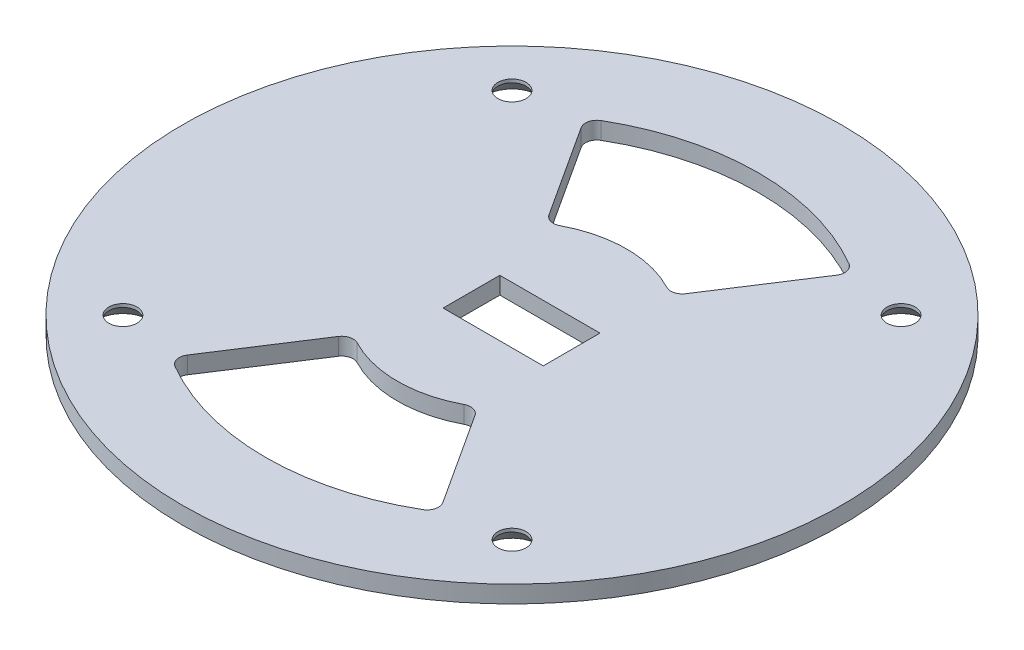
ISO-10303-21;
HEADER;
FILE_DESCRIPTION(('STEP AP214'),'2;1');
FILE_NAME('part.step','',(''),(''),'','','');
FILE_SCHEMA(('AUTOMOTIVE_DESIGN { 1 0 10303 214 1 1 1 1 }'));
ENDSEC;
DATA;
#1=APPLICATION_CONTEXT('core data for automotive mechanical design processes');
#2=APPLICATION_PROTOCOL_DEFINITION('international standard','automotive_design',2000,#1);
#3=PRODUCT_CONTEXT('',#1,'mechanical');
#4=PRODUCT('Part','Part','',(#3));
#5=PRODUCT_RELATED_PRODUCT_CATEGORY('part','',(#4));
#6=PRODUCT_DEFINITION_FORMATION('','',#4);
#7=PRODUCT_DEFINITION_CONTEXT('part definition',#1,'design');
#8=PRODUCT_DEFINITION('design','',#6,#7);
#9=PRODUCT_DEFINITION_SHAPE('','',#8);
#10=(LENGTH_UNIT() NAMED_UNIT(*) SI_UNIT(.MILLI.,.METRE.));
#11=(NAMED_UNIT(*) PLANE_ANGLE_UNIT() SI_UNIT($,.RADIAN.));
#12=(NAMED_UNIT(*) SI_UNIT($,.STERADIAN.) SOLID_ANGLE_UNIT());
#13=UNCERTAINTY_MEASURE_WITH_UNIT(LENGTH_MEASURE(1.E-05),#10,'distance_accuracy_value','');
#14=(GEOMETRIC_REPRESENTATION_CONTEXT(3) GLOBAL_UNCERTAINTY_ASSIGNED_CONTEXT((#13)) GLOBAL_UNIT_ASSIGNED_CONTEXT((#10,
#11,#12)) REPRESENTATION_CONTEXT('',''));
#15=CARTESIAN_POINT('',(0.,0.,0.));
#16=DIRECTION('',(0.,0.,1.));
#17=DIRECTION('',(1.,0.,0.));
#18=AXIS2_PLACEMENT_3D('',#15,#16,#17);
#19=CARTESIAN_POINT('',(0.,3.,0.));
#20=DIRECTION('',(0.,1.,0.));
#21=DIRECTION('',(0.,0.,1.));
#22=AXIS2_PLACEMENT_3D('',#19,#20,#21);
#23=PLANE('',#22);
#24=DIRECTION('',(-0.54427744861526,0.,0.838905274109576));
#25=VECTOR('',#24,1.);
#26=CARTESIAN_POINT('',(23.4039302904562,3.,-36.0729267867118));
#27=LINE('',#26,#25);
#28=CARTESIAN_POINT('',(22.2888094607203,3.,-34.3541696570257));
#29=VERTEX_POINT('',#28);
#30=CARTESIAN_POINT('',(11.9245214459175,3.,-18.3794936895948));
#31=VERTEX_POINT('',#30);
#32=EDGE_CURVE('E359',#29,#31,#27,.T.);
#33=ORIENTED_EDGE('',*,*,#32,.T.);
#34=CARTESIAN_POINT('',(10.2467108976983,3.,-19.4680485868253));
#35=DIRECTION('',(0.,1.,0.));
#36=DIRECTION('',(0.,0.,1.));
#37=AXIS2_PLACEMENT_3D('',#34,#35,#36);
#38=CIRCLE('',#37,2.);
#39=CARTESIAN_POINT('',(9.31519172518029,3.,-17.698225988023));
#40=VERTEX_POINT('',#39);
#41=EDGE_CURVE('E309',#31,#40,#38,.F.);
#42=ORIENTED_EDGE('',*,*,#41,.T.);
#43=CARTESIAN_POINT('',(0.,3.,0.));
#44=DIRECTION('',(0.,1.,0.));
#45=DIRECTION('',(0.,0.,1.));
#46=AXIS2_PLACEMENT_3D('',#43,#44,#45);
#47=CIRCLE('',#46,20.);
#48=CARTESIAN_POINT('',(-9.31519172518029,3.,-17.698225988023));
#49=VERTEX_POINT('',#48);
#50=EDGE_CURVE('E629',#40,#49,#47,.T.);
#51=ORIENTED_EDGE('',*,*,#50,.T.);
#52=CARTESIAN_POINT('',(-10.2467108976983,3.,-19.4680485868253));
#53=DIRECTION('',(0.,1.,0.));
#54=DIRECTION('',(0.,0.,1.));
#55=AXIS2_PLACEMENT_3D('',#52,#53,#54);
#56=CIRCLE('',#55,2.);
#57=CARTESIAN_POINT('',(-11.9245214459175,3.,-18.3794936895948));
#58=VERTEX_POINT('',#57);
#59=EDGE_CURVE('E313',#49,#58,#56,.F.);
#60=ORIENTED_EDGE('',*,*,#59,.T.);
#61=DIRECTION('',(-0.54427744861526,0.,-0.838905274109576));
#62=VECTOR('',#61,1.);
#63=CARTESIAN_POINT('',(-23.4039302904562,3.,-36.0729267867118));
#64=LINE('',#63,#62);
#65=CARTESIAN_POINT('',(-22.2888094607203,3.,-34.3541696570257));
#66=VERTEX_POINT('',#65);
#67=EDGE_CURVE('E623',#58,#66,#64,.T.);
#68=ORIENTED_EDGE('',*,*,#67,.T.);
#69=CARTESIAN_POINT('',(-20.6109989125012,3.,-35.4427245542562));
#70=DIRECTION('',(0.,1.,0.));
#71=DIRECTION('',(0.,0.,1.));
#72=AXIS2_PLACEMENT_3D('',#69,#70,#71);
#73=CIRCLE('',#72,2.);
#74=CARTESIAN_POINT('',(-21.6164134935988,3.,-37.1716379471467));
#75=VERTEX_POINT('',#74);
#76=EDGE_CURVE('E305',#66,#75,#73,.F.);
#77=ORIENTED_EDGE('',*,*,#76,.T.);
#78=CARTESIAN_POINT('',(0.,3.,0.));
#79=DIRECTION('',(0.,-1.,0.));
#80=DIRECTION('',(0.,0.,1.));
#81=AXIS2_PLACEMENT_3D('',#78,#79,#80);
#82=CIRCLE('',#81,43.);
#83=CARTESIAN_POINT('',(21.6164134935988,3.,-37.1716379471467));
#84=VERTEX_POINT('',#83);
#85=EDGE_CURVE('E621',#75,#84,#82,.T.);
#86=ORIENTED_EDGE('',*,*,#85,.T.);
#87=CARTESIAN_POINT('',(20.6109989125012,3.,-35.4427245542562));
#88=DIRECTION('',(0.,1.,0.));
#89=DIRECTION('',(0.,0.,1.));
#90=AXIS2_PLACEMENT_3D('',#87,#88,#89);
#91=CIRCLE('',#90,2.);
#92=EDGE_CURVE('E301',#84,#29,#91,.F.);
#93=ORIENTED_EDGE('',*,*,#92,.T.);
#94=EDGE_LOOP('',(#33,#42,#51,#60,#68,#77,#86,#93));
#95=FACE_BOUND('',#94,.T.);
#96=DIRECTION('',(0.54427744861526,0.,0.838905274109576));
#97=VECTOR('',#96,1.);
#98=CARTESIAN_POINT('',(23.4039302904562,3.,36.0729267867118));
#99=LINE('',#98,#97);
#100=CARTESIAN_POINT('',(11.9245214459175,3.,18.3794936895948));
#101=VERTEX_POINT('',#100);
#102=CARTESIAN_POINT('',(22.2888094607203,3.,34.3541696570257));
#103=VERTEX_POINT('',#102);
#104=EDGE_CURVE('E199',#101,#103,#99,.T.);
#105=ORIENTED_EDGE('',*,*,#104,.T.);
#106=CARTESIAN_POINT('',(20.6109989125012,3.,35.4427245542562));
#107=DIRECTION('',(0.,1.,0.));
#108=DIRECTION('',(0.,0.,1.));
#109=AXIS2_PLACEMENT_3D('',#106,#107,#108);
#110=CIRCLE('',#109,2.);
#111=CARTESIAN_POINT('',(21.6164134935988,3.,37.1716379471467));
#112=VERTEX_POINT('',#111);
#113=EDGE_CURVE('E11',#103,#112,#110,.F.);
#114=ORIENTED_EDGE('',*,*,#113,.T.);
#115=CARTESIAN_POINT('',(0.,3.,0.));
#116=DIRECTION('',(0.,-1.,0.));
#117=DIRECTION('',(0.,0.,-1.));
#118=AXIS2_PLACEMENT_3D('',#115,#116,#117);
#119=CIRCLE('',#118,43.);
#120=CARTESIAN_POINT('',(-21.6164134935988,3.,37.1716379471467));
#121=VERTEX_POINT('',#120);
#122=EDGE_CURVE('E337',#112,#121,#119,.T.);
#123=ORIENTED_EDGE('',*,*,#122,.T.);
#124=CARTESIAN_POINT('',(-20.6109989125012,3.,35.4427245542562));
#125=DIRECTION('',(0.,1.,0.));
#126=DIRECTION('',(0.,0.,1.));
#127=AXIS2_PLACEMENT_3D('',#124,#125,#126);
#128=CIRCLE('',#127,2.);
#129=CARTESIAN_POINT('',(-22.2888094607203,3.,34.3541696570257));
#130=VERTEX_POINT('',#129);
#131=EDGE_CURVE('E317',#121,#130,#128,.F.);
#132=ORIENTED_EDGE('',*,*,#131,.T.);
#133=DIRECTION('',(0.54427744861526,0.,-0.838905274109576));
#134=VECTOR('',#133,1.);
#135=CARTESIAN_POINT('',(-23.4039302904562,3.,36.0729267867118));
#136=LINE('',#135,#134);
#137=CARTESIAN_POINT('',(-11.9245214459175,3.,18.3794936895948));
#138=VERTEX_POINT('',#137);
#139=EDGE_CURVE('E346',#130,#138,#136,.T.);
#140=ORIENTED_EDGE('',*,*,#139,.T.);
#141=CARTESIAN_POINT('',(-10.2467108976983,3.,19.4680485868253));
#142=DIRECTION('',(0.,1.,0.));
#143=DIRECTION('',(0.,0.,1.));
#144=AXIS2_PLACEMENT_3D('',#141,#142,#143);
#145=CIRCLE('',#144,2.);
#146=CARTESIAN_POINT('',(-9.31519172518029,3.,17.698225988023));
#147=VERTEX_POINT('',#146);
#148=EDGE_CURVE('E321',#138,#147,#145,.F.);
#149=ORIENTED_EDGE('',*,*,#148,.T.);
#150=CARTESIAN_POINT('',(0.,3.,0.));
#151=DIRECTION('',(0.,1.,0.));
#152=DIRECTION('',(0.,0.,-1.));
#153=AXIS2_PLACEMENT_3D('',#150,#151,#152);
#154=CIRCLE('',#153,20.);
#155=CARTESIAN_POINT('',(9.31519172518029,3.,17.698225988023));
#156=VERTEX_POINT('',#155);
#157=EDGE_CURVE('E349',#147,#156,#154,.T.);
#158=ORIENTED_EDGE('',*,*,#157,.T.);
#159=CARTESIAN_POINT('',(10.2467108976983,3.,19.4680485868253));
#160=DIRECTION('',(0.,1.,0.));
#161=DIRECTION('',(0.,0.,1.));
#162=AXIS2_PLACEMENT_3D('',#159,#160,#161);
#163=CIRCLE('',#162,2.);
#164=EDGE_CURVE('E56',#156,#101,#163,.F.);
#165=ORIENTED_EDGE('',*,*,#164,.T.);
#166=EDGE_LOOP('',(#105,#114,#123,#132,#140,#149,#158,#165));
#167=FACE_BOUND('',#166,.T.);
#168=DIRECTION('',(0.,0.,-1.));
#169=VECTOR('',#168,1.);
#170=CARTESIAN_POINT('',(-7.07499999999999,3.,-4.95));
#171=LINE('',#170,#169);
#172=CARTESIAN_POINT('',(-7.07499999999999,3.,4.95));
#173=VERTEX_POINT('',#172);
#174=CARTESIAN_POINT('',(-7.07499999999999,3.,-4.95));
#175=VERTEX_POINT('',#174);
#176=EDGE_CURVE('E176',#173,#175,#171,.T.);
#177=ORIENTED_EDGE('',*,*,#176,.T.);
#178=DIRECTION('',(-1.,0.,0.));
#179=VECTOR('',#178,1.);
#180=CARTESIAN_POINT('',(-2.99999999999999,3.,-4.95));
#181=LINE('',#180,#179);
#182=CARTESIAN_POINT('',(10.4,3.,-4.95));
#183=VERTEX_POINT('',#182);
#184=EDGE_CURVE('E182',#183,#175,#181,.T.);
#185=ORIENTED_EDGE('',*,*,#184,.F.);
#186=DIRECTION('',(0.,0.,1.));
#187=VECTOR('',#186,1.);
#188=CARTESIAN_POINT('',(10.4,3.,-4.95));
#189=LINE('',#188,#187);
#190=CARTESIAN_POINT('',(10.4,3.,4.95));
#191=VERTEX_POINT('',#190);
#192=EDGE_CURVE('E178',#183,#191,#189,.T.);
#193=ORIENTED_EDGE('',*,*,#192,.T.);
#194=DIRECTION('',(1.,0.,0.));
#195=VECTOR('',#194,1.);
#196=CARTESIAN_POINT('',(-2.99999999999999,3.,4.95));
#197=LINE('',#196,#195);
#198=EDGE_CURVE('E172',#173,#191,#197,.T.);
#199=ORIENTED_EDGE('',*,*,#198,.F.);
#200=EDGE_LOOP('',(#177,#185,#193,#199));
#201=FACE_BOUND('',#200,.T.);
#202=CARTESIAN_POINT('',(-33.9411254969524,3.,33.9411254969543));
#203=DIRECTION('',(0.,-1.,0.));
#204=DIRECTION('',(0.,0.,-1.));
#205=AXIS2_PLACEMENT_3D('',#202,#203,#204);
#206=CIRCLE('',#205,2.45744999999999);
#207=CARTESIAN_POINT('',(-33.9411254969524,3.,31.4836754969543));
#208=VERTEX_POINT('',#207);
#209=EDGE_CURVE('E221',#208,#208,#206,.T.);
#210=ORIENTED_EDGE('',*,*,#209,.T.);
#211=EDGE_LOOP('',(#210));
#212=FACE_BOUND('',#211,.T.);
#213=CARTESIAN_POINT('',(33.9411254969562,3.,33.9411254969524));
#214=DIRECTION('',(0.,-1.,0.));
#215=DIRECTION('',(0.,0.,-1.));
#216=AXIS2_PLACEMENT_3D('',#213,#214,#215);
#217=CIRCLE('',#216,2.45744999999999);
#218=CARTESIAN_POINT('',(33.9411254969562,3.,31.4836754969524));
#219=VERTEX_POINT('',#218);
#220=EDGE_CURVE('E230',#219,#219,#217,.T.);
#221=ORIENTED_EDGE('',*,*,#220,.T.);
#222=EDGE_LOOP('',(#221));
#223=FACE_BOUND('',#222,.T.);
#224=CARTESIAN_POINT('',(33.9411254969543,3.,-33.9411254969562));
#225=DIRECTION('',(0.,-1.,0.));
#226=DIRECTION('',(0.,0.,-1.));
#227=AXIS2_PLACEMENT_3D('',#224,#225,#226);
#228=CIRCLE('',#227,2.45744999999999);
#229=CARTESIAN_POINT('',(33.9411254969543,3.,-36.3985754969562));
#230=VERTEX_POINT('',#229);
#231=EDGE_CURVE('E239',#230,#230,#228,.T.);
#232=ORIENTED_EDGE('',*,*,#231,.T.);
#233=EDGE_LOOP('',(#232));
#234=FACE_BOUND('',#233,.T.);
#235=CARTESIAN_POINT('',(-33.9411254969543,3.,-33.9411254969543));
#236=DIRECTION('',(0.,-1.,0.));
#237=DIRECTION('',(0.,0.,-1.));
#238=AXIS2_PLACEMENT_3D('',#235,#236,#237);
#239=CIRCLE('',#238,2.45744999999999);
#240=CARTESIAN_POINT('',(-33.9411254969543,3.,-36.3985754969543));
#241=VERTEX_POINT('',#240);
#242=EDGE_CURVE('E248',#241,#241,#239,.T.);
#243=ORIENTED_EDGE('',*,*,#242,.T.);
#244=EDGE_LOOP('',(#243));
#245=FACE_BOUND('',#244,.T.);
#246=CARTESIAN_POINT('',(0.,3.,0.));
#247=DIRECTION('',(0.,1.,0.));
#248=DIRECTION('',(0.,0.,1.));
#249=AXIS2_PLACEMENT_3D('',#246,#247,#248);
#250=CIRCLE('',#249,57.5);
#251=CARTESIAN_POINT('',(0.,3.,57.5));
#252=VERTEX_POINT('',#251);
#253=EDGE_CURVE('E255',#252,#252,#250,.T.);
#254=ORIENTED_EDGE('',*,*,#253,.T.);
#255=EDGE_LOOP('',(#254));
#256=FACE_BOUND('',#255,.T.);
#257=ADVANCED_FACE('F34',(#95,#167,#201,#212,#223,#234,#245,#256),#23,.T.);
#258=CARTESIAN_POINT('',(0.,0.,0.));
#259=DIRECTION('',(0.,1.,0.));
#260=DIRECTION('',(0.,0.,1.));
#261=AXIS2_PLACEMENT_3D('',#258,#259,#260);
#262=PLANE('',#261);
#263=DIRECTION('',(-0.54427744861526,0.,-0.838905274109576));
#264=VECTOR('',#263,1.);
#265=CARTESIAN_POINT('',(-23.4039302904562,0.,-36.0729267867118));
#266=LINE('',#265,#264);
#267=CARTESIAN_POINT('',(-11.9245214459175,0.,-18.3794936895948));
#268=VERTEX_POINT('',#267);
#269=CARTESIAN_POINT('',(-22.2888094607203,0.,-34.3541696570257));
#270=VERTEX_POINT('',#269);
#271=EDGE_CURVE('E609',#268,#270,#266,.T.);
#272=ORIENTED_EDGE('',*,*,#271,.F.);
#273=CARTESIAN_POINT('',(-10.2467108976983,0.,-19.4680485868253));
#274=DIRECTION('',(0.,1.,0.));
#275=DIRECTION('',(0.,0.,1.));
#276=AXIS2_PLACEMENT_3D('',#273,#274,#275);
#277=CIRCLE('',#276,2.);
#278=CARTESIAN_POINT('',(-9.31519172518029,0.,-17.698225988023));
#279=VERTEX_POINT('',#278);
#280=EDGE_CURVE('E311',#268,#279,#277,.T.);
#281=ORIENTED_EDGE('',*,*,#280,.T.);
#282=CARTESIAN_POINT('',(0.,0.,0.));
#283=DIRECTION('',(0.,1.,0.));
#284=DIRECTION('',(0.,0.,1.));
#285=AXIS2_PLACEMENT_3D('',#282,#283,#284);
#286=CIRCLE('',#285,20.);
#287=CARTESIAN_POINT('',(9.31519172518029,0.,-17.698225988023));
#288=VERTEX_POINT('',#287);
#289=EDGE_CURVE('E615',#288,#279,#286,.T.);
#290=ORIENTED_EDGE('',*,*,#289,.F.);
#291=CARTESIAN_POINT('',(10.2467108976983,0.,-19.4680485868253));
#292=DIRECTION('',(0.,1.,0.));
#293=DIRECTION('',(0.,0.,1.));
#294=AXIS2_PLACEMENT_3D('',#291,#292,#293);
#295=CIRCLE('',#294,2.);
#296=CARTESIAN_POINT('',(11.9245214459175,0.,-18.3794936895948));
#297=VERTEX_POINT('',#296);
#298=EDGE_CURVE('E307',#288,#297,#295,.T.);
#299=ORIENTED_EDGE('',*,*,#298,.T.);
#300=DIRECTION('',(-0.54427744861526,0.,0.838905274109576));
#301=VECTOR('',#300,1.);
#302=CARTESIAN_POINT('',(23.4039302904562,0.,-36.0729267867118));
#303=LINE('',#302,#301);
#304=CARTESIAN_POINT('',(22.2888094607203,0.,-34.3541696570257));
#305=VERTEX_POINT('',#304);
#306=EDGE_CURVE('E352',#305,#297,#303,.T.);
#307=ORIENTED_EDGE('',*,*,#306,.F.);
#308=CARTESIAN_POINT('',(20.6109989125012,0.,-35.4427245542562));
#309=DIRECTION('',(0.,1.,0.));
#310=DIRECTION('',(0.,0.,1.));
#311=AXIS2_PLACEMENT_3D('',#308,#309,#310);
#312=CIRCLE('',#311,2.);
#313=CARTESIAN_POINT('',(21.6164134935988,0.,-37.1716379471467));
#314=VERTEX_POINT('',#313);
#315=EDGE_CURVE('E299',#305,#314,#312,.T.);
#316=ORIENTED_EDGE('',*,*,#315,.T.);
#317=CARTESIAN_POINT('',(0.,0.,0.));
#318=DIRECTION('',(0.,-1.,0.));
#319=DIRECTION('',(0.,0.,1.));
#320=AXIS2_PLACEMENT_3D('',#317,#318,#319);
#321=CIRCLE('',#320,43.);
#322=CARTESIAN_POINT('',(-21.6164134935988,0.,-37.1716379471467));
#323=VERTEX_POINT('',#322);
#324=EDGE_CURVE('E614',#323,#314,#321,.T.);
#325=ORIENTED_EDGE('',*,*,#324,.F.);
#326=CARTESIAN_POINT('',(-20.6109989125012,0.,-35.4427245542562));
#327=DIRECTION('',(0.,1.,0.));
#328=DIRECTION('',(0.,0.,1.));
#329=AXIS2_PLACEMENT_3D('',#326,#327,#328);
#330=CIRCLE('',#329,2.);
#331=EDGE_CURVE('E303',#323,#270,#330,.T.);
#332=ORIENTED_EDGE('',*,*,#331,.T.);
#333=EDGE_LOOP('',(#272,#281,#290,#299,#307,#316,#325,#332));
#334=FACE_BOUND('',#333,.T.);
#335=DIRECTION('',(0.54427744861526,0.,-0.838905274109576));
#336=VECTOR('',#335,1.);
#337=CARTESIAN_POINT('',(-23.4039302904562,0.,36.0729267867118));
#338=LINE('',#337,#336);
#339=CARTESIAN_POINT('',(-22.2888094607203,0.,34.3541696570257));
#340=VERTEX_POINT('',#339);
#341=CARTESIAN_POINT('',(-11.9245214459175,0.,18.3794936895948));
#342=VERTEX_POINT('',#341);
#343=EDGE_CURVE('E358',#340,#342,#338,.T.);
#344=ORIENTED_EDGE('',*,*,#343,.F.);
#345=CARTESIAN_POINT('',(-20.6109989125012,0.,35.4427245542562));
#346=DIRECTION('',(0.,1.,0.));
#347=DIRECTION('',(0.,0.,1.));
#348=AXIS2_PLACEMENT_3D('',#345,#346,#347);
#349=CIRCLE('',#348,2.);
#350=CARTESIAN_POINT('',(-21.6164134935988,0.,37.1716379471467));
#351=VERTEX_POINT('',#350);
#352=EDGE_CURVE('E315',#340,#351,#349,.T.);
#353=ORIENTED_EDGE('',*,*,#352,.T.);
#354=CARTESIAN_POINT('',(0.,0.,0.));
#355=DIRECTION('',(0.,-1.,0.));
#356=DIRECTION('',(0.,0.,-1.));
#357=AXIS2_PLACEMENT_3D('',#354,#355,#356);
#358=CIRCLE('',#357,43.);
#359=CARTESIAN_POINT('',(21.6164134935988,0.,37.1716379471467));
#360=VERTEX_POINT('',#359);
#361=EDGE_CURVE('E332',#360,#351,#358,.T.);
#362=ORIENTED_EDGE('',*,*,#361,.F.);
#363=CARTESIAN_POINT('',(20.6109989125012,0.,35.4427245542562));
#364=DIRECTION('',(0.,1.,0.));
#365=DIRECTION('',(0.,0.,1.));
#366=AXIS2_PLACEMENT_3D('',#363,#364,#365);
#367=CIRCLE('',#366,2.);
#368=CARTESIAN_POINT('',(22.2888094607203,0.,34.3541696570257));
#369=VERTEX_POINT('',#368);
#370=EDGE_CURVE('E42',#360,#369,#367,.T.);
#371=ORIENTED_EDGE('',*,*,#370,.T.);
#372=DIRECTION('',(0.54427744861526,0.,0.838905274109576));
#373=VECTOR('',#372,1.);
#374=CARTESIAN_POINT('',(23.4039302904562,0.,36.0729267867118));
#375=LINE('',#374,#373);
#376=CARTESIAN_POINT('',(11.9245214459175,0.,18.3794936895948));
#377=VERTEX_POINT('',#376);
#378=EDGE_CURVE('E202',#377,#369,#375,.T.);
#379=ORIENTED_EDGE('',*,*,#378,.F.);
#380=CARTESIAN_POINT('',(10.2467108976983,0.,19.4680485868253));
#381=DIRECTION('',(0.,1.,0.));
#382=DIRECTION('',(0.,0.,1.));
#383=AXIS2_PLACEMENT_3D('',#380,#381,#382);
#384=CIRCLE('',#383,2.);
#385=CARTESIAN_POINT('',(9.31519172518029,0.,17.698225988023));
#386=VERTEX_POINT('',#385);
#387=EDGE_CURVE('E323',#377,#386,#384,.T.);
#388=ORIENTED_EDGE('',*,*,#387,.T.);
#389=CARTESIAN_POINT('',(0.,0.,0.));
#390=DIRECTION('',(0.,1.,0.));
#391=DIRECTION('',(0.,0.,-1.));
#392=AXIS2_PLACEMENT_3D('',#389,#390,#391);
#393=CIRCLE('',#392,20.);
#394=CARTESIAN_POINT('',(-9.31519172518029,0.,17.698225988023));
#395=VERTEX_POINT('',#394);
#396=EDGE_CURVE('E338',#395,#386,#393,.T.);
#397=ORIENTED_EDGE('',*,*,#396,.F.);
#398=CARTESIAN_POINT('',(-10.2467108976983,0.,19.4680485868253));
#399=DIRECTION('',(0.,1.,0.));
#400=DIRECTION('',(0.,0.,1.));
#401=AXIS2_PLACEMENT_3D('',#398,#399,#400);
#402=CIRCLE('',#401,2.);
#403=EDGE_CURVE('E319',#395,#342,#402,.T.);
#404=ORIENTED_EDGE('',*,*,#403,.T.);
#405=EDGE_LOOP('',(#344,#353,#362,#371,#379,#388,#397,#404));
#406=FACE_BOUND('',#405,.T.);
#407=CARTESIAN_POINT('',(-33.9411254969524,0.,33.9411254969543));
#408=DIRECTION('',(0.,-1.,0.));
#409=DIRECTION('',(0.,0.,-1.));
#410=AXIS2_PLACEMENT_3D('',#407,#408,#409);
#411=CIRCLE('',#410,4.5593);
#412=CARTESIAN_POINT('',(-33.9411254969524,0.,29.3818254969543));
#413=VERTEX_POINT('',#412);
#414=EDGE_CURVE('E213',#413,#413,#411,.T.);
#415=ORIENTED_EDGE('',*,*,#414,.F.);
#416=EDGE_LOOP('',(#415));
#417=FACE_BOUND('',#416,.T.);
#418=CARTESIAN_POINT('',(33.9411254969562,0.,33.9411254969524));
#419=DIRECTION('',(0.,-1.,0.));
#420=DIRECTION('',(0.,0.,-1.));
#421=AXIS2_PLACEMENT_3D('',#418,#419,#420);
#422=CIRCLE('',#421,4.5593);
#423=CARTESIAN_POINT('',(33.9411254969562,0.,29.3818254969524));
#424=VERTEX_POINT('',#423);
#425=EDGE_CURVE('E224',#424,#424,#422,.T.);
#426=ORIENTED_EDGE('',*,*,#425,.F.);
#427=EDGE_LOOP('',(#426));
#428=FACE_BOUND('',#427,.T.);
#429=CARTESIAN_POINT('',(33.9411254969543,0.,-33.9411254969562));
#430=DIRECTION('',(0.,-1.,0.));
#431=DIRECTION('',(0.,0.,-1.));
#432=AXIS2_PLACEMENT_3D('',#429,#430,#431);
#433=CIRCLE('',#432,4.5593);
#434=CARTESIAN_POINT('',(33.9411254969543,0.,-38.5004254969562));
#435=VERTEX_POINT('',#434);
#436=EDGE_CURVE('E233',#435,#435,#433,.T.);
#437=ORIENTED_EDGE('',*,*,#436,.F.);
#438=EDGE_LOOP('',(#437));
#439=FACE_BOUND('',#438,.T.);
#440=CARTESIAN_POINT('',(-33.9411254969543,0.,-33.9411254969543));
#441=DIRECTION('',(0.,-1.,0.));
#442=DIRECTION('',(0.,0.,-1.));
#443=AXIS2_PLACEMENT_3D('',#440,#441,#442);
#444=CIRCLE('',#443,4.5593);
#445=CARTESIAN_POINT('',(-33.9411254969543,0.,-38.5004254969543));
#446=VERTEX_POINT('',#445);
#447=EDGE_CURVE('E242',#446,#446,#444,.T.);
#448=ORIENTED_EDGE('',*,*,#447,.F.);
#449=EDGE_LOOP('',(#448));
#450=FACE_BOUND('',#449,.T.);
#451=DIRECTION('',(-1.,0.,0.));
#452=VECTOR('',#451,1.);
#453=CARTESIAN_POINT('',(-2.99999999999999,0.,-4.95));
#454=LINE('',#453,#452);
#455=CARTESIAN_POINT('',(10.4,0.,-4.95));
#456=VERTEX_POINT('',#455);
#457=CARTESIAN_POINT('',(-7.07499999999999,0.,-4.95));
#458=VERTEX_POINT('',#457);
#459=EDGE_CURVE('E183',#456,#458,#454,.T.);
#460=ORIENTED_EDGE('',*,*,#459,.T.);
#461=DIRECTION('',(0.,0.,-1.));
#462=VECTOR('',#461,1.);
#463=CARTESIAN_POINT('',(-7.07499999999999,0.,-4.95));
#464=LINE('',#463,#462);
#465=CARTESIAN_POINT('',(-7.07499999999999,0.,4.95));
#466=VERTEX_POINT('',#465);
#467=EDGE_CURVE('E197',#466,#458,#464,.T.);
#468=ORIENTED_EDGE('',*,*,#467,.F.);
#469=DIRECTION('',(1.,0.,0.));
#470=VECTOR('',#469,1.);
#471=CARTESIAN_POINT('',(-2.99999999999999,0.,4.95));
#472=LINE('',#471,#470);
#473=CARTESIAN_POINT('',(10.4,0.,4.95));
#474=VERTEX_POINT('',#473);
#475=EDGE_CURVE('E188',#466,#474,#472,.T.);
#476=ORIENTED_EDGE('',*,*,#475,.T.);
#477=DIRECTION('',(0.,0.,1.));
#478=VECTOR('',#477,1.);
#479=CARTESIAN_POINT('',(10.4,0.,-4.95));
#480=LINE('',#479,#478);
#481=EDGE_CURVE('E205',#456,#474,#480,.T.);
#482=ORIENTED_EDGE('',*,*,#481,.F.);
#483=EDGE_LOOP('',(#460,#468,#476,#482));
#484=FACE_BOUND('',#483,.T.);
#485=CARTESIAN_POINT('',(0.,0.,0.));
#486=DIRECTION('',(0.,1.,0.));
#487=DIRECTION('',(0.,0.,1.));
#488=AXIS2_PLACEMENT_3D('',#485,#486,#487);
#489=CIRCLE('',#488,57.5);
#490=CARTESIAN_POINT('',(0.,0.,57.5));
#491=VERTEX_POINT('',#490);
#492=EDGE_CURVE('E252',#491,#491,#489,.T.);
#493=ORIENTED_EDGE('',*,*,#492,.F.);
#494=EDGE_LOOP('',(#493));
#495=FACE_BOUND('',#494,.T.);
#496=ADVANCED_FACE('F329',(#334,#406,#417,#428,#439,#450,#484,#495),#262,.F.);
#497=CARTESIAN_POINT('',(0.,3.,0.));
#498=DIRECTION('',(0.,-1.,0.));
#499=DIRECTION('',(0.,0.,-1.));
#500=AXIS2_PLACEMENT_3D('',#497,#498,#499);
#501=CYLINDRICAL_SURFACE('',#500,57.5);
#502=ORIENTED_EDGE('',*,*,#253,.F.);
#503=EDGE_LOOP('',(#502));
#504=FACE_BOUND('',#503,.T.);
#505=ORIENTED_EDGE('',*,*,#492,.T.);
#506=EDGE_LOOP('',(#505));
#507=FACE_BOUND('',#506,.T.);
#508=ADVANCED_FACE('F385',(#504,#507),#501,.T.);
#509=CARTESIAN_POINT('',(-2.99999999999999,3.,4.95));
#510=DIRECTION('',(0.,0.,-1.));
#511=DIRECTION('',(-1.,0.,0.));
#512=AXIS2_PLACEMENT_3D('',#509,#510,#511);
#513=PLANE('',#512);
#514=ORIENTED_EDGE('',*,*,#475,.F.);
#515=DIRECTION('',(0.,-1.,0.));
#516=VECTOR('',#515,1.);
#517=CARTESIAN_POINT('',(-7.07499999999999,3.,4.95));
#518=LINE('',#517,#516);
#519=EDGE_CURVE('E186',#173,#466,#518,.T.);
#520=ORIENTED_EDGE('',*,*,#519,.F.);
#521=ORIENTED_EDGE('',*,*,#198,.T.);
#522=DIRECTION('',(0.,-1.,0.));
#523=VECTOR('',#522,1.);
#524=CARTESIAN_POINT('',(10.4,3.,4.95));
#525=LINE('',#524,#523);
#526=EDGE_CURVE('E211',#191,#474,#525,.T.);
#527=ORIENTED_EDGE('',*,*,#526,.T.);
#528=EDGE_LOOP('',(#514,#520,#521,#527));
#529=FACE_BOUND('',#528,.T.);
#530=ADVANCED_FACE('F187',(#529),#513,.T.);
#531=CARTESIAN_POINT('',(-2.99999999999999,3.,-4.95));
#532=DIRECTION('',(0.,0.,1.));
#533=DIRECTION('',(1.,0.,0.));
#534=AXIS2_PLACEMENT_3D('',#531,#532,#533);
#535=PLANE('',#534);
#536=ORIENTED_EDGE('',*,*,#459,.F.);
#537=DIRECTION('',(0.,-1.,0.));
#538=VECTOR('',#537,1.);
#539=CARTESIAN_POINT('',(10.4,3.,-4.95));
#540=LINE('',#539,#538);
#541=EDGE_CURVE('E208',#183,#456,#540,.T.);
#542=ORIENTED_EDGE('',*,*,#541,.F.);
#543=ORIENTED_EDGE('',*,*,#184,.T.);
#544=DIRECTION('',(0.,-1.,0.));
#545=VECTOR('',#544,1.);
#546=CARTESIAN_POINT('',(-7.07499999999999,3.,-4.95));
#547=LINE('',#546,#545);
#548=EDGE_CURVE('E192',#175,#458,#547,.T.);
#549=ORIENTED_EDGE('',*,*,#548,.T.);
#550=EDGE_LOOP('',(#536,#542,#543,#549));
#551=FACE_BOUND('',#550,.T.);
#552=ADVANCED_FACE('F473',(#551),#535,.T.);
#553=CARTESIAN_POINT('',(-33.9411254969543,0.,-33.9411254969543));
#554=DIRECTION('',(0.,-1.,0.));
#555=DIRECTION('',(0.,0.,-1.));
#556=AXIS2_PLACEMENT_3D('',#553,#554,#555);
#557=CYLINDRICAL_SURFACE('',#556,2.45744999999999);
#558=ORIENTED_EDGE('',*,*,#242,.F.);
#559=EDGE_LOOP('',(#558));
#560=FACE_BOUND('',#559,.T.);
#561=CARTESIAN_POINT('',(-33.9411254969543,2.41790183671748,-33.9411254969543));
#562=DIRECTION('',(0.,-1.,0.));
#563=DIRECTION('',(0.,0.,-1.));
#564=AXIS2_PLACEMENT_3D('',#561,#562,#563);
#565=CIRCLE('',#564,2.45745);
#566=CARTESIAN_POINT('',(-33.9411254969543,2.41790183671748,-36.3985754969543));
#567=VERTEX_POINT('',#566);
#568=EDGE_CURVE('E245',#567,#567,#565,.T.);
#569=ORIENTED_EDGE('',*,*,#568,.T.);
#570=EDGE_LOOP('',(#569));
#571=FACE_BOUND('',#570,.T.);
#572=ADVANCED_FACE('F470',(#560,#571),#557,.F.);
#573=CARTESIAN_POINT('',(-33.9411254969543,0.,-33.9411254969543));
#574=DIRECTION('',(0.,-1.,0.));
#575=DIRECTION('',(0.,0.,-1.));
#576=AXIS2_PLACEMENT_3D('',#573,#574,#575);
#577=CONICAL_SURFACE('',#576,4.5593,0.715584993317675);
#578=ORIENTED_EDGE('',*,*,#568,.F.);
#579=EDGE_LOOP('',(#578));
#580=FACE_BOUND('',#579,.T.);
#581=ORIENTED_EDGE('',*,*,#447,.T.);
#582=EDGE_LOOP('',(#581));
#583=FACE_BOUND('',#582,.T.);
#584=ADVANCED_FACE('F466',(#580,#583),#577,.F.);
#585=CARTESIAN_POINT('',(33.9411254969543,0.,-33.9411254969562));
#586=DIRECTION('',(0.,-1.,0.));
#587=DIRECTION('',(0.,0.,-1.));
#588=AXIS2_PLACEMENT_3D('',#585,#586,#587);
#589=CYLINDRICAL_SURFACE('',#588,2.45744999999999);
#590=ORIENTED_EDGE('',*,*,#231,.F.);
#591=EDGE_LOOP('',(#590));
#592=FACE_BOUND('',#591,.T.);
#593=CARTESIAN_POINT('',(33.9411254969543,2.41790183671748,-33.9411254969562));
#594=DIRECTION('',(0.,-1.,0.));
#595=DIRECTION('',(0.,0.,-1.));
#596=AXIS2_PLACEMENT_3D('',#593,#594,#595);
#597=CIRCLE('',#596,2.45745);
#598=CARTESIAN_POINT('',(33.9411254969543,2.41790183671748,-36.3985754969562));
#599=VERTEX_POINT('',#598);
#600=EDGE_CURVE('E236',#599,#599,#597,.T.);
#601=ORIENTED_EDGE('',*,*,#600,.T.);
#602=EDGE_LOOP('',(#601));
#603=FACE_BOUND('',#602,.T.);
#604=ADVANCED_FACE('F462',(#592,#603),#589,.F.);
#605=CARTESIAN_POINT('',(33.9411254969543,0.,-33.9411254969562));
#606=DIRECTION('',(0.,-1.,0.));
#607=DIRECTION('',(0.,0.,-1.));
#608=AXIS2_PLACEMENT_3D('',#605,#606,#607);
#609=CONICAL_SURFACE('',#608,4.5593,0.715584993317674);
#610=ORIENTED_EDGE('',*,*,#600,.F.);
#611=EDGE_LOOP('',(#610));
#612=FACE_BOUND('',#611,.T.);
#613=ORIENTED_EDGE('',*,*,#436,.T.);
#614=EDGE_LOOP('',(#613));
#615=FACE_BOUND('',#614,.T.);
#616=ADVANCED_FACE('F458',(#612,#615),#609,.F.);
#617=CARTESIAN_POINT('',(33.9411254969562,0.,33.9411254969524));
#618=DIRECTION('',(0.,-1.,0.));
#619=DIRECTION('',(0.,0.,-1.));
#620=AXIS2_PLACEMENT_3D('',#617,#618,#619);
#621=CYLINDRICAL_SURFACE('',#620,2.45744999999999);
#622=ORIENTED_EDGE('',*,*,#220,.F.);
#623=EDGE_LOOP('',(#622));
#624=FACE_BOUND('',#623,.T.);
#625=CARTESIAN_POINT('',(33.9411254969562,2.41790183671748,33.9411254969524));
#626=DIRECTION('',(0.,-1.,0.));
#627=DIRECTION('',(0.,0.,-1.));
#628=AXIS2_PLACEMENT_3D('',#625,#626,#627);
#629=CIRCLE('',#628,2.45745);
#630=CARTESIAN_POINT('',(33.9411254969562,2.41790183671748,31.4836754969524));
#631=VERTEX_POINT('',#630);
#632=EDGE_CURVE('E227',#631,#631,#629,.T.);
#633=ORIENTED_EDGE('',*,*,#632,.T.);
#634=EDGE_LOOP('',(#633));
#635=FACE_BOUND('',#634,.T.);
#636=ADVANCED_FACE('F454',(#624,#635),#621,.F.);
#637=CARTESIAN_POINT('',(33.9411254969562,0.,33.9411254969524));
#638=DIRECTION('',(0.,-1.,0.));
#639=DIRECTION('',(0.,0.,-1.));
#640=AXIS2_PLACEMENT_3D('',#637,#638,#639);
#641=CONICAL_SURFACE('',#640,4.5593,0.715584993317674);
#642=ORIENTED_EDGE('',*,*,#632,.F.);
#643=EDGE_LOOP('',(#642));
#644=FACE_BOUND('',#643,.T.);
#645=ORIENTED_EDGE('',*,*,#425,.T.);
#646=EDGE_LOOP('',(#645));
#647=FACE_BOUND('',#646,.T.);
#648=ADVANCED_FACE('F450',(#644,#647),#641,.F.);
#649=CARTESIAN_POINT('',(-33.9411254969524,0.,33.9411254969543));
#650=DIRECTION('',(0.,-1.,0.));
#651=DIRECTION('',(0.,0.,-1.));
#652=AXIS2_PLACEMENT_3D('',#649,#650,#651);
#653=CYLINDRICAL_SURFACE('',#652,2.45744999999999);
#654=ORIENTED_EDGE('',*,*,#209,.F.);
#655=EDGE_LOOP('',(#654));
#656=FACE_BOUND('',#655,.T.);
#657=CARTESIAN_POINT('',(-33.9411254969524,2.41790183671748,33.9411254969543));
#658=DIRECTION('',(0.,-1.,0.));
#659=DIRECTION('',(0.,0.,-1.));
#660=AXIS2_PLACEMENT_3D('',#657,#658,#659);
#661=CIRCLE('',#660,2.45745);
#662=CARTESIAN_POINT('',(-33.9411254969524,2.41790183671748,31.4836754969543));
#663=VERTEX_POINT('',#662);
#664=EDGE_CURVE('E218',#663,#663,#661,.T.);
#665=ORIENTED_EDGE('',*,*,#664,.T.);
#666=EDGE_LOOP('',(#665));
#667=FACE_BOUND('',#666,.T.);
#668=ADVANCED_FACE('F446',(#656,#667),#653,.F.);
#669=CARTESIAN_POINT('',(-33.9411254969524,0.,33.9411254969543));
#670=DIRECTION('',(0.,-1.,0.));
#671=DIRECTION('',(0.,0.,-1.));
#672=AXIS2_PLACEMENT_3D('',#669,#670,#671);
#673=CONICAL_SURFACE('',#672,4.5593,0.715584993317675);
#674=ORIENTED_EDGE('',*,*,#664,.F.);
#675=EDGE_LOOP('',(#674));
#676=FACE_BOUND('',#675,.T.);
#677=ORIENTED_EDGE('',*,*,#414,.T.);
#678=EDGE_LOOP('',(#677));
#679=FACE_BOUND('',#678,.T.);
#680=ADVANCED_FACE('F442',(#676,#679),#673,.F.);
#681=CARTESIAN_POINT('',(10.4,3.,-4.95));
#682=DIRECTION('',(1.,0.,0.));
#683=DIRECTION('',(0.,0.,-1.));
#684=AXIS2_PLACEMENT_3D('',#681,#682,#683);
#685=PLANE('',#684);
#686=ORIENTED_EDGE('',*,*,#481,.T.);
#687=ORIENTED_EDGE('',*,*,#526,.F.);
#688=ORIENTED_EDGE('',*,*,#192,.F.);
#689=ORIENTED_EDGE('',*,*,#541,.T.);
#690=EDGE_LOOP('',(#686,#687,#688,#689));
#691=FACE_BOUND('',#690,.T.);
#692=ADVANCED_FACE('F439',(#691),#685,.F.);
#693=CARTESIAN_POINT('',(-7.07499999999999,3.,-4.95));
#694=DIRECTION('',(-1.,0.,0.));
#695=DIRECTION('',(0.,0.,1.));
#696=AXIS2_PLACEMENT_3D('',#693,#694,#695);
#697=PLANE('',#696);
#698=ORIENTED_EDGE('',*,*,#467,.T.);
#699=ORIENTED_EDGE('',*,*,#548,.F.);
#700=ORIENTED_EDGE('',*,*,#176,.F.);
#701=ORIENTED_EDGE('',*,*,#519,.T.);
#702=EDGE_LOOP('',(#698,#699,#700,#701));
#703=FACE_BOUND('',#702,.T.);
#704=ADVANCED_FACE('F195',(#703),#697,.F.);
#705=CARTESIAN_POINT('',(0.,3.,0.));
#706=DIRECTION('',(0.,-1.,0.));
#707=DIRECTION('',(0.,0.,-1.));
#708=AXIS2_PLACEMENT_3D('',#705,#706,#707);
#709=CYLINDRICAL_SURFACE('',#708,43.);
#710=ORIENTED_EDGE('',*,*,#361,.T.);
#711=DIRECTION('',(0.,-1.,0.));
#712=VECTOR('',#711,1.);
#713=CARTESIAN_POINT('',(-21.6164134935988,3.,37.1716379471467));
#714=LINE('',#713,#712);
#715=EDGE_CURVE('E288',#351,#121,#714,.F.);
#716=ORIENTED_EDGE('',*,*,#715,.T.);
#717=ORIENTED_EDGE('',*,*,#122,.F.);
#718=DIRECTION('',(0.,-1.,0.));
#719=VECTOR('',#718,1.);
#720=CARTESIAN_POINT('',(21.6164134935988,3.,37.1716379471467));
#721=LINE('',#720,#719);
#722=EDGE_CURVE('E285',#112,#360,#721,.T.);
#723=ORIENTED_EDGE('',*,*,#722,.T.);
#724=EDGE_LOOP('',(#710,#716,#717,#723));
#725=FACE_BOUND('',#724,.T.);
#726=ADVANCED_FACE('F344',(#725),#709,.F.);
#727=CARTESIAN_POINT('',(23.4039302904562,3.,36.0729267867118));
#728=DIRECTION('',(0.838905274109576,0.,-0.54427744861526));
#729=DIRECTION('',(-0.54427744861526,0.,-0.838905274109576));
#730=AXIS2_PLACEMENT_3D('',#727,#728,#729);
#731=PLANE('',#730);
#732=ORIENTED_EDGE('',*,*,#104,.F.);
#733=DIRECTION('',(0.,1.,0.));
#734=VECTOR('',#733,1.);
#735=CARTESIAN_POINT('',(11.9245214459175,0.,18.3794936895948));
#736=LINE('',#735,#734);
#737=EDGE_CURVE('E296',#101,#377,#736,.F.);
#738=ORIENTED_EDGE('',*,*,#737,.T.);
#739=ORIENTED_EDGE('',*,*,#378,.T.);
#740=DIRECTION('',(0.,1.,0.));
#741=VECTOR('',#740,1.);
#742=CARTESIAN_POINT('',(22.2888094607203,3.,34.3541696570257));
#743=LINE('',#742,#741);
#744=EDGE_CURVE('E49',#369,#103,#743,.T.);
#745=ORIENTED_EDGE('',*,*,#744,.T.);
#746=EDGE_LOOP('',(#732,#738,#739,#745));
#747=FACE_BOUND('',#746,.T.);
#748=ADVANCED_FACE('F335',(#747),#731,.F.);
#749=CARTESIAN_POINT('',(0.,3.,0.));
#750=DIRECTION('',(0.,-1.,0.));
#751=DIRECTION('',(0.,0.,-1.));
#752=AXIS2_PLACEMENT_3D('',#749,#750,#751);
#753=CYLINDRICAL_SURFACE('',#752,20.);
#754=ORIENTED_EDGE('',*,*,#157,.F.);
#755=DIRECTION('',(0.,-1.,0.));
#756=VECTOR('',#755,1.);
#757=CARTESIAN_POINT('',(-9.31519172518029,3.,17.698225988023));
#758=LINE('',#757,#756);
#759=EDGE_CURVE('E292',#147,#395,#758,.T.);
#760=ORIENTED_EDGE('',*,*,#759,.T.);
#761=ORIENTED_EDGE('',*,*,#396,.T.);
#762=DIRECTION('',(0.,-1.,0.));
#763=VECTOR('',#762,1.);
#764=CARTESIAN_POINT('',(9.31519172518029,3.,17.698225988023));
#765=LINE('',#764,#763);
#766=EDGE_CURVE('E290',#386,#156,#765,.F.);
#767=ORIENTED_EDGE('',*,*,#766,.T.);
#768=EDGE_LOOP('',(#754,#760,#761,#767));
#769=FACE_BOUND('',#768,.T.);
#770=ADVANCED_FACE('F366',(#769),#753,.T.);
#771=CARTESIAN_POINT('',(-23.4039302904562,3.,36.0729267867118));
#772=DIRECTION('',(-0.838905274109576,0.,-0.54427744861526));
#773=DIRECTION('',(-0.54427744861526,0.,0.838905274109576));
#774=AXIS2_PLACEMENT_3D('',#771,#772,#773);
#775=PLANE('',#774);
#776=ORIENTED_EDGE('',*,*,#139,.F.);
#777=DIRECTION('',(0.,1.,0.));
#778=VECTOR('',#777,1.);
#779=CARTESIAN_POINT('',(-22.2888094607203,0.,34.3541696570257));
#780=LINE('',#779,#778);
#781=EDGE_CURVE('E282',#130,#340,#780,.F.);
#782=ORIENTED_EDGE('',*,*,#781,.T.);
#783=ORIENTED_EDGE('',*,*,#343,.T.);
#784=DIRECTION('',(0.,1.,0.));
#785=VECTOR('',#784,1.);
#786=CARTESIAN_POINT('',(-11.9245214459175,3.,18.3794936895948));
#787=LINE('',#786,#785);
#788=EDGE_CURVE('E280',#342,#138,#787,.T.);
#789=ORIENTED_EDGE('',*,*,#788,.T.);
#790=EDGE_LOOP('',(#776,#782,#783,#789));
#791=FACE_BOUND('',#790,.T.);
#792=ADVANCED_FACE('F420',(#791),#775,.F.);
#793=CARTESIAN_POINT('',(0.,3.,0.));
#794=DIRECTION('',(0.,-1.,0.));
#795=DIRECTION('',(0.,0.,-1.));
#796=AXIS2_PLACEMENT_3D('',#793,#794,#795);
#797=CYLINDRICAL_SURFACE('',#796,20.);
#798=ORIENTED_EDGE('',*,*,#50,.F.);
#799=DIRECTION('',(0.,-1.,0.));
#800=VECTOR('',#799,1.);
#801=CARTESIAN_POINT('',(9.31519172518029,3.,-17.698225988023));
#802=LINE('',#801,#800);
#803=EDGE_CURVE('E277',#40,#288,#802,.T.);
#804=ORIENTED_EDGE('',*,*,#803,.T.);
#805=ORIENTED_EDGE('',*,*,#289,.T.);
#806=DIRECTION('',(0.,-1.,0.));
#807=VECTOR('',#806,1.);
#808=CARTESIAN_POINT('',(-9.31519172518029,3.,-17.698225988023));
#809=LINE('',#808,#807);
#810=EDGE_CURVE('E275',#279,#49,#809,.F.);
#811=ORIENTED_EDGE('',*,*,#810,.T.);
#812=EDGE_LOOP('',(#798,#804,#805,#811));
#813=FACE_BOUND('',#812,.T.);
#814=ADVANCED_FACE('F423',(#813),#797,.T.);
#815=CARTESIAN_POINT('',(23.4039302904562,3.,-36.0729267867118));
#816=DIRECTION('',(0.838905274109576,0.,0.54427744861526));
#817=DIRECTION('',(0.54427744861526,0.,-0.838905274109576));
#818=AXIS2_PLACEMENT_3D('',#815,#816,#817);
#819=PLANE('',#818);
#820=ORIENTED_EDGE('',*,*,#32,.F.);
#821=DIRECTION('',(0.,1.,0.));
#822=VECTOR('',#821,1.);
#823=CARTESIAN_POINT('',(22.2888094607203,0.,-34.3541696570257));
#824=LINE('',#823,#822);
#825=EDGE_CURVE('E262',#29,#305,#824,.F.);
#826=ORIENTED_EDGE('',*,*,#825,.T.);
#827=ORIENTED_EDGE('',*,*,#306,.T.);
#828=DIRECTION('',(0.,1.,0.));
#829=VECTOR('',#828,1.);
#830=CARTESIAN_POINT('',(11.9245214459175,3.,-18.3794936895948));
#831=LINE('',#830,#829);
#832=EDGE_CURVE('E258',#297,#31,#831,.T.);
#833=ORIENTED_EDGE('',*,*,#832,.T.);
#834=EDGE_LOOP('',(#820,#826,#827,#833));
#835=FACE_BOUND('',#834,.T.);
#836=ADVANCED_FACE('F429',(#835),#819,.F.);
#837=CARTESIAN_POINT('',(0.,3.,0.));
#838=DIRECTION('',(0.,-1.,0.));
#839=DIRECTION('',(0.,0.,-1.));
#840=AXIS2_PLACEMENT_3D('',#837,#838,#839);
#841=CYLINDRICAL_SURFACE('',#840,43.);
#842=ORIENTED_EDGE('',*,*,#324,.T.);
#843=DIRECTION('',(0.,-1.,0.));
#844=VECTOR('',#843,1.);
#845=CARTESIAN_POINT('',(21.6164134935988,3.,-37.1716379471467));
#846=LINE('',#845,#844);
#847=EDGE_CURVE('E268',#314,#84,#846,.F.);
#848=ORIENTED_EDGE('',*,*,#847,.T.);
#849=ORIENTED_EDGE('',*,*,#85,.F.);
#850=DIRECTION('',(0.,-1.,0.));
#851=VECTOR('',#850,1.);
#852=CARTESIAN_POINT('',(-21.6164134935988,3.,-37.1716379471467));
#853=LINE('',#852,#851);
#854=EDGE_CURVE('E265',#75,#323,#853,.T.);
#855=ORIENTED_EDGE('',*,*,#854,.T.);
#856=EDGE_LOOP('',(#842,#848,#849,#855));
#857=FACE_BOUND('',#856,.T.);
#858=ADVANCED_FACE('F540',(#857),#841,.F.);
#859=CARTESIAN_POINT('',(-23.4039302904562,3.,-36.0729267867118));
#860=DIRECTION('',(-0.838905274109576,0.,0.54427744861526));
#861=DIRECTION('',(0.54427744861526,0.,0.838905274109576));
#862=AXIS2_PLACEMENT_3D('',#859,#860,#861);
#863=PLANE('',#862);
#864=ORIENTED_EDGE('',*,*,#271,.T.);
#865=DIRECTION('',(0.,1.,0.));
#866=VECTOR('',#865,1.);
#867=CARTESIAN_POINT('',(-22.2888094607203,3.,-34.3541696570257));
#868=LINE('',#867,#866);
#869=EDGE_CURVE('E273',#270,#66,#868,.T.);
#870=ORIENTED_EDGE('',*,*,#869,.T.);
#871=ORIENTED_EDGE('',*,*,#67,.F.);
#872=DIRECTION('',(0.,1.,0.));
#873=VECTOR('',#872,1.);
#874=CARTESIAN_POINT('',(-11.9245214459175,0.,-18.3794936895948));
#875=LINE('',#874,#873);
#876=EDGE_CURVE('E270',#58,#268,#875,.F.);
#877=ORIENTED_EDGE('',*,*,#876,.T.);
#878=EDGE_LOOP('',(#864,#870,#871,#877));
#879=FACE_BOUND('',#878,.T.);
#880=ADVANCED_FACE('F399',(#879),#863,.F.);
#881=CARTESIAN_POINT('',(20.6109989125012,3.,-35.4427245542562));
#882=DIRECTION('',(0.,-1.,0.));
#883=DIRECTION('',(0.,0.,-1.));
#884=AXIS2_PLACEMENT_3D('',#881,#882,#883);
#885=CYLINDRICAL_SURFACE('',#884,2.);
#886=ORIENTED_EDGE('',*,*,#92,.F.);
#887=ORIENTED_EDGE('',*,*,#847,.F.);
#888=ORIENTED_EDGE('',*,*,#315,.F.);
#889=ORIENTED_EDGE('',*,*,#825,.F.);
#890=EDGE_LOOP('',(#886,#887,#888,#889));
#891=FACE_BOUND('',#890,.T.);
#892=ADVANCED_FACE('F395',(#891),#885,.F.);
#893=CARTESIAN_POINT('',(-20.6109989125012,3.,-35.4427245542562));
#894=DIRECTION('',(0.,-1.,0.));
#895=DIRECTION('',(0.,0.,-1.));
#896=AXIS2_PLACEMENT_3D('',#893,#894,#895);
#897=CYLINDRICAL_SURFACE('',#896,2.);
#898=ORIENTED_EDGE('',*,*,#76,.F.);
#899=ORIENTED_EDGE('',*,*,#869,.F.);
#900=ORIENTED_EDGE('',*,*,#331,.F.);
#901=ORIENTED_EDGE('',*,*,#854,.F.);
#902=EDGE_LOOP('',(#898,#899,#900,#901));
#903=FACE_BOUND('',#902,.T.);
#904=ADVANCED_FACE('F398',(#903),#897,.F.);
#905=CARTESIAN_POINT('',(10.2467108976983,3.,-19.4680485868253));
#906=DIRECTION('',(0.,-1.,0.));
#907=DIRECTION('',(0.,0.,-1.));
#908=AXIS2_PLACEMENT_3D('',#905,#906,#907);
#909=CYLINDRICAL_SURFACE('',#908,2.);
#910=ORIENTED_EDGE('',*,*,#41,.F.);
#911=ORIENTED_EDGE('',*,*,#832,.F.);
#912=ORIENTED_EDGE('',*,*,#298,.F.);
#913=ORIENTED_EDGE('',*,*,#803,.F.);
#914=EDGE_LOOP('',(#910,#911,#912,#913));
#915=FACE_BOUND('',#914,.T.);
#916=ADVANCED_FACE('F403',(#915),#909,.F.);
#917=CARTESIAN_POINT('',(-10.2467108976983,3.,-19.4680485868253));
#918=DIRECTION('',(0.,-1.,0.));
#919=DIRECTION('',(0.,0.,-1.));
#920=AXIS2_PLACEMENT_3D('',#917,#918,#919);
#921=CYLINDRICAL_SURFACE('',#920,2.);
#922=ORIENTED_EDGE('',*,*,#59,.F.);
#923=ORIENTED_EDGE('',*,*,#810,.F.);
#924=ORIENTED_EDGE('',*,*,#280,.F.);
#925=ORIENTED_EDGE('',*,*,#876,.F.);
#926=EDGE_LOOP('',(#922,#923,#924,#925));
#927=FACE_BOUND('',#926,.T.);
#928=ADVANCED_FACE('F407',(#927),#921,.F.);
#929=CARTESIAN_POINT('',(-20.6109989125012,3.,35.4427245542562));
#930=DIRECTION('',(0.,-1.,0.));
#931=DIRECTION('',(0.,0.,-1.));
#932=AXIS2_PLACEMENT_3D('',#929,#930,#931);
#933=CYLINDRICAL_SURFACE('',#932,2.);
#934=ORIENTED_EDGE('',*,*,#131,.F.);
#935=ORIENTED_EDGE('',*,*,#715,.F.);
#936=ORIENTED_EDGE('',*,*,#352,.F.);
#937=ORIENTED_EDGE('',*,*,#781,.F.);
#938=EDGE_LOOP('',(#934,#935,#936,#937));
#939=FACE_BOUND('',#938,.T.);
#940=ADVANCED_FACE('F376',(#939),#933,.F.);
#941=CARTESIAN_POINT('',(-10.2467108976983,3.,19.4680485868253));
#942=DIRECTION('',(0.,-1.,0.));
#943=DIRECTION('',(0.,0.,-1.));
#944=AXIS2_PLACEMENT_3D('',#941,#942,#943);
#945=CYLINDRICAL_SURFACE('',#944,2.);
#946=ORIENTED_EDGE('',*,*,#148,.F.);
#947=ORIENTED_EDGE('',*,*,#788,.F.);
#948=ORIENTED_EDGE('',*,*,#403,.F.);
#949=ORIENTED_EDGE('',*,*,#759,.F.);
#950=EDGE_LOOP('',(#946,#947,#948,#949));
#951=FACE_BOUND('',#950,.T.);
#952=ADVANCED_FACE('F371',(#951),#945,.F.);
#953=CARTESIAN_POINT('',(10.2467108976983,3.,19.4680485868253));
#954=DIRECTION('',(0.,-1.,0.));
#955=DIRECTION('',(0.,0.,-1.));
#956=AXIS2_PLACEMENT_3D('',#953,#954,#955);
#957=CYLINDRICAL_SURFACE('',#956,2.);
#958=ORIENTED_EDGE('',*,*,#164,.F.);
#959=ORIENTED_EDGE('',*,*,#766,.F.);
#960=ORIENTED_EDGE('',*,*,#387,.F.);
#961=ORIENTED_EDGE('',*,*,#737,.F.);
#962=EDGE_LOOP('',(#958,#959,#960,#961));
#963=FACE_BOUND('',#962,.T.);
#964=ADVANCED_FACE('F369',(#963),#957,.F.);
#965=CARTESIAN_POINT('',(20.6109989125012,3.,35.4427245542562));
#966=DIRECTION('',(0.,-1.,0.));
#967=DIRECTION('',(0.,0.,-1.));
#968=AXIS2_PLACEMENT_3D('',#965,#966,#967);
#969=CYLINDRICAL_SURFACE('',#968,2.);
#970=ORIENTED_EDGE('',*,*,#113,.F.);
#971=ORIENTED_EDGE('',*,*,#744,.F.);
#972=ORIENTED_EDGE('',*,*,#370,.F.);
#973=ORIENTED_EDGE('',*,*,#722,.F.);
#974=EDGE_LOOP('',(#970,#971,#972,#973));
#975=FACE_BOUND('',#974,.T.);
#976=ADVANCED_FACE('F36',(#975),#969,.F.);
#977=CLOSED_SHELL('',(#257,#496,#508,#530,#552,#572,#584,#604,#616,#636,#648,#668,#680,#692,
#704,#726,#748,#770,#792,#814,#836,#858,#880,#892,#904,#916,#928,#940,#952,#964,#976));
#978=MANIFOLD_SOLID_BREP('B2',#977);
#979=ADVANCED_BREP_SHAPE_REPRESENTATION('',(#18,#978),#14);
#980=SHAPE_DEFINITION_REPRESENTATION(#9,#979);
ENDSEC;
END-ISO-10303-21;
